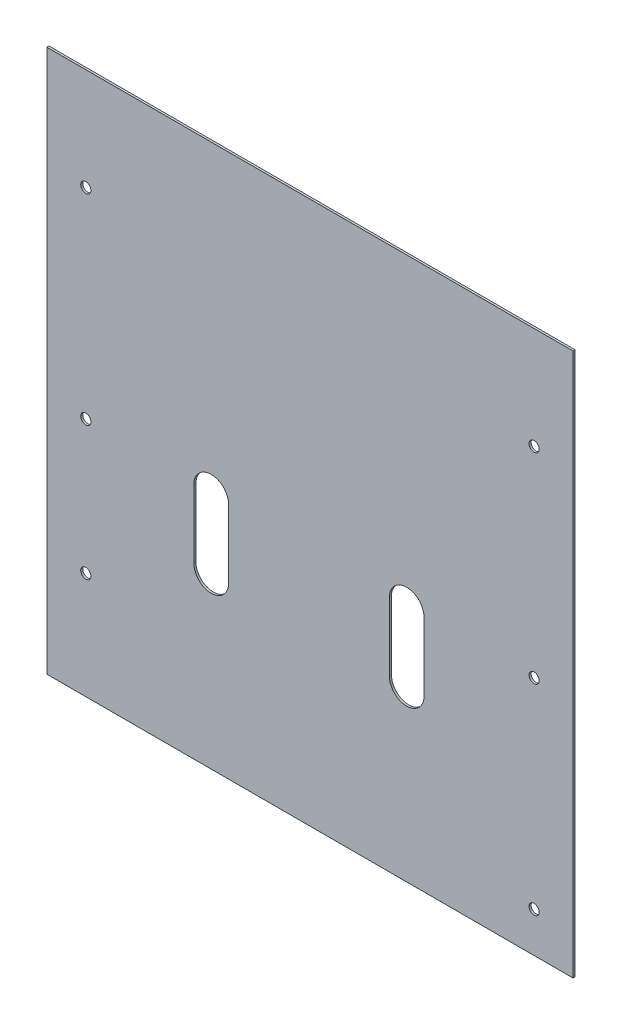
ISO-10303-21;
HEADER;
FILE_DESCRIPTION(('STEP AP214'),'2;1');
FILE_NAME('part.step','',(''),(''),'','','');
FILE_SCHEMA(('AUTOMOTIVE_DESIGN { 1 0 10303 214 1 1 1 1 }'));
ENDSEC;
DATA;
#1=APPLICATION_CONTEXT('core data for automotive mechanical design processes');
#2=APPLICATION_PROTOCOL_DEFINITION('international standard','automotive_design',2000,#1);
#3=PRODUCT_CONTEXT('',#1,'mechanical');
#4=PRODUCT('Part','Part','',(#3));
#5=PRODUCT_RELATED_PRODUCT_CATEGORY('part','',(#4));
#6=PRODUCT_DEFINITION_FORMATION('','',#4);
#7=PRODUCT_DEFINITION_CONTEXT('part definition',#1,'design');
#8=PRODUCT_DEFINITION('design','',#6,#7);
#9=PRODUCT_DEFINITION_SHAPE('','',#8);
#10=(LENGTH_UNIT() NAMED_UNIT(*) SI_UNIT(.MILLI.,.METRE.));
#11=(NAMED_UNIT(*) PLANE_ANGLE_UNIT() SI_UNIT($,.RADIAN.));
#12=(NAMED_UNIT(*) SI_UNIT($,.STERADIAN.) SOLID_ANGLE_UNIT());
#13=UNCERTAINTY_MEASURE_WITH_UNIT(LENGTH_MEASURE(1.E-05),#10,'distance_accuracy_value','');
#14=(GEOMETRIC_REPRESENTATION_CONTEXT(3) GLOBAL_UNCERTAINTY_ASSIGNED_CONTEXT((#13)) GLOBAL_UNIT_ASSIGNED_CONTEXT((#10,
#11,#12)) REPRESENTATION_CONTEXT('',''));
#15=CARTESIAN_POINT('',(0.,0.,0.));
#16=DIRECTION('',(0.,0.,1.));
#17=DIRECTION('',(1.,0.,0.));
#18=AXIS2_PLACEMENT_3D('',#15,#16,#17);
#19=CARTESIAN_POINT('',(0.,0.,0.));
#20=DIRECTION('',(0.,0.,-1.));
#21=DIRECTION('',(-1.,0.,0.));
#22=AXIS2_PLACEMENT_3D('',#19,#20,#21);
#23=PLANE('',#22);
#24=CARTESIAN_POINT('',(-20.9050000000001,-222.,0.));
#25=DIRECTION('',(0.,0.,1.));
#26=DIRECTION('',(1.,0.,0.));
#27=AXIS2_PLACEMENT_3D('',#24,#25,#26);
#28=CIRCLE('',#27,1.905);
#29=CARTESIAN_POINT('',(-19.0000000000001,-222.,0.));
#30=VERTEX_POINT('',#29);
#31=EDGE_CURVE('E268',#30,#30,#28,.T.);
#32=ORIENTED_EDGE('',*,*,#31,.F.);
#33=EDGE_LOOP('',(#32));
#34=FACE_BOUND('',#33,.T.);
#35=CARTESIAN_POINT('',(-20.9050000000003,-147.,0.));
#36=DIRECTION('',(0.,0.,1.));
#37=DIRECTION('',(1.,0.,0.));
#38=AXIS2_PLACEMENT_3D('',#35,#36,#37);
#39=CIRCLE('',#38,1.905);
#40=CARTESIAN_POINT('',(-19.0000000000003,-147.,0.));
#41=VERTEX_POINT('',#40);
#42=EDGE_CURVE('E272',#41,#41,#39,.T.);
#43=ORIENTED_EDGE('',*,*,#42,.F.);
#44=EDGE_LOOP('',(#43));
#45=FACE_BOUND('',#44,.T.);
#46=CARTESIAN_POINT('',(-20.9050000000003,-71.9999999999999,0.));
#47=DIRECTION('',(0.,0.,1.));
#48=DIRECTION('',(1.,0.,0.));
#49=AXIS2_PLACEMENT_3D('',#46,#47,#48);
#50=CIRCLE('',#49,1.905);
#51=CARTESIAN_POINT('',(-19.0000000000003,-71.9999999999999,0.));
#52=VERTEX_POINT('',#51);
#53=EDGE_CURVE('E282',#52,#52,#50,.T.);
#54=ORIENTED_EDGE('',*,*,#53,.F.);
#55=EDGE_LOOP('',(#54));
#56=FACE_BOUND('',#55,.T.);
#57=CARTESIAN_POINT('',(-188.645,-197.,0.));
#58=DIRECTION('',(0.,0.,1.));
#59=DIRECTION('',(1.,0.,0.));
#60=AXIS2_PLACEMENT_3D('',#57,#58,#59);
#61=CIRCLE('',#60,1.90499999999999);
#62=CARTESIAN_POINT('',(-186.74,-197.,0.));
#63=VERTEX_POINT('',#62);
#64=EDGE_CURVE('E290',#63,#63,#61,.T.);
#65=ORIENTED_EDGE('',*,*,#64,.F.);
#66=EDGE_LOOP('',(#65));
#67=FACE_BOUND('',#66,.T.);
#68=CARTESIAN_POINT('',(-188.645,-147.,0.));
#69=DIRECTION('',(0.,0.,1.));
#70=DIRECTION('',(1.,0.,0.));
#71=AXIS2_PLACEMENT_3D('',#68,#69,#70);
#72=CIRCLE('',#71,1.90499999999999);
#73=CARTESIAN_POINT('',(-186.74,-147.,0.));
#74=VERTEX_POINT('',#73);
#75=EDGE_CURVE('E298',#74,#74,#72,.T.);
#76=ORIENTED_EDGE('',*,*,#75,.F.);
#77=EDGE_LOOP('',(#76));
#78=FACE_BOUND('',#77,.T.);
#79=CARTESIAN_POINT('',(-188.645,-72.,0.));
#80=DIRECTION('',(0.,0.,1.));
#81=DIRECTION('',(1.,0.,0.));
#82=AXIS2_PLACEMENT_3D('',#79,#80,#81);
#83=CIRCLE('',#82,1.90499999999999);
#84=CARTESIAN_POINT('',(-186.74,-72.,0.));
#85=VERTEX_POINT('',#84);
#86=EDGE_CURVE('E306',#85,#85,#83,.T.);
#87=ORIENTED_EDGE('',*,*,#86,.F.);
#88=EDGE_LOOP('',(#87));
#89=FACE_BOUND('',#88,.T.);
#90=DIRECTION('',(0.,-1.,0.));
#91=VECTOR('',#90,1.);
#92=CARTESIAN_POINT('',(-62.0692532358968,-173.5,0.));
#93=LINE('',#92,#91);
#94=CARTESIAN_POINT('',(-62.0692532358968,-148.,0.));
#95=VERTEX_POINT('',#94);
#96=CARTESIAN_POINT('',(-62.0692532358968,-173.5,0.));
#97=VERTEX_POINT('',#96);
#98=EDGE_CURVE('E368',#95,#97,#93,.T.);
#99=ORIENTED_EDGE('',*,*,#98,.T.);
#100=CARTESIAN_POINT('',(-68.5692532358968,-173.5,0.));
#101=DIRECTION('',(0.,0.,-1.));
#102=DIRECTION('',(0.,1.,0.));
#103=AXIS2_PLACEMENT_3D('',#100,#101,#102);
#104=CIRCLE('',#103,6.5);
#105=CARTESIAN_POINT('',(-75.0692532358968,-173.5,0.));
#106=VERTEX_POINT('',#105);
#107=EDGE_CURVE('E355',#97,#106,#104,.T.);
#108=ORIENTED_EDGE('',*,*,#107,.T.);
#109=DIRECTION('',(0.,1.,0.));
#110=VECTOR('',#109,1.);
#111=CARTESIAN_POINT('',(-75.0692532358968,-173.5,0.));
#112=LINE('',#111,#110);
#113=CARTESIAN_POINT('',(-75.0692532358968,-148.,0.));
#114=VERTEX_POINT('',#113);
#115=EDGE_CURVE('E359',#106,#114,#112,.T.);
#116=ORIENTED_EDGE('',*,*,#115,.T.);
#117=CARTESIAN_POINT('',(-68.5692532358968,-148.,0.));
#118=DIRECTION('',(0.,0.,-1.));
#119=DIRECTION('',(0.,1.,0.));
#120=AXIS2_PLACEMENT_3D('',#117,#118,#119);
#121=CIRCLE('',#120,6.5);
#122=EDGE_CURVE('E364',#114,#95,#121,.T.);
#123=ORIENTED_EDGE('',*,*,#122,.T.);
#124=EDGE_LOOP('',(#99,#108,#116,#123));
#125=FACE_BOUND('',#124,.T.);
#126=DIRECTION('',(0.,-1.,0.));
#127=VECTOR('',#126,1.);
#128=CARTESIAN_POINT('',(-135.221253235897,-173.5,0.));
#129=LINE('',#128,#127);
#130=CARTESIAN_POINT('',(-135.221253235897,-148.,0.));
#131=VERTEX_POINT('',#130);
#132=CARTESIAN_POINT('',(-135.221253235897,-173.5,0.));
#133=VERTEX_POINT('',#132);
#134=EDGE_CURVE('E326',#131,#133,#129,.T.);
#135=ORIENTED_EDGE('',*,*,#134,.T.);
#136=CARTESIAN_POINT('',(-141.721253235897,-173.5,0.));
#137=DIRECTION('',(0.,0.,-1.));
#138=DIRECTION('',(0.,1.,0.));
#139=AXIS2_PLACEMENT_3D('',#136,#137,#138);
#140=CIRCLE('',#139,6.49999999999995);
#141=CARTESIAN_POINT('',(-148.221253235897,-173.5,0.));
#142=VERTEX_POINT('',#141);
#143=EDGE_CURVE('E313',#133,#142,#140,.T.);
#144=ORIENTED_EDGE('',*,*,#143,.T.);
#145=DIRECTION('',(0.,1.,0.));
#146=VECTOR('',#145,1.);
#147=CARTESIAN_POINT('',(-148.221253235897,-173.5,0.));
#148=LINE('',#147,#146);
#149=CARTESIAN_POINT('',(-148.221253235897,-148.,0.));
#150=VERTEX_POINT('',#149);
#151=EDGE_CURVE('E317',#142,#150,#148,.T.);
#152=ORIENTED_EDGE('',*,*,#151,.T.);
#153=CARTESIAN_POINT('',(-141.721253235897,-148.,0.));
#154=DIRECTION('',(0.,0.,-1.));
#155=DIRECTION('',(0.,1.,0.));
#156=AXIS2_PLACEMENT_3D('',#153,#154,#155);
#157=CIRCLE('',#156,6.49999999999995);
#158=EDGE_CURVE('E322',#150,#131,#157,.T.);
#159=ORIENTED_EDGE('',*,*,#158,.T.);
#160=EDGE_LOOP('',(#135,#144,#152,#159));
#161=FACE_BOUND('',#160,.T.);
#162=DIRECTION('',(-1.,0.,0.));
#163=VECTOR('',#162,1.);
#164=CARTESIAN_POINT('',(-203.2,-237.,0.));
#165=LINE('',#164,#163);
#166=CARTESIAN_POINT('',(-6.35000000000001,-237.,0.));
#167=VERTEX_POINT('',#166);
#168=CARTESIAN_POINT('',(-203.2,-237.,0.));
#169=VERTEX_POINT('',#168);
#170=EDGE_CURVE('E166',#167,#169,#165,.T.);
#171=ORIENTED_EDGE('',*,*,#170,.F.);
#172=DIRECTION('',(0.,-1.,0.));
#173=VECTOR('',#172,1.);
#174=CARTESIAN_POINT('',(-6.35000000000001,-237.,0.));
#175=LINE('',#174,#173);
#176=CARTESIAN_POINT('',(-6.35000000000006,-33.7999999999999,0.));
#177=VERTEX_POINT('',#176);
#178=EDGE_CURVE('E142',#177,#167,#175,.T.);
#179=ORIENTED_EDGE('',*,*,#178,.F.);
#180=DIRECTION('',(-1.,0.,0.));
#181=VECTOR('',#180,1.);
#182=CARTESIAN_POINT('',(-6.35000000000006,-33.7999999999999,0.));
#183=LINE('',#182,#181);
#184=CARTESIAN_POINT('',(-203.2,-33.8,0.));
#185=VERTEX_POINT('',#184);
#186=EDGE_CURVE('E146',#177,#185,#183,.T.);
#187=ORIENTED_EDGE('',*,*,#186,.T.);
#188=DIRECTION('',(0.,1.,0.));
#189=VECTOR('',#188,1.);
#190=CARTESIAN_POINT('',(-203.2,-237.,0.));
#191=LINE('',#190,#189);
#192=EDGE_CURVE('E134',#169,#185,#191,.T.);
#193=ORIENTED_EDGE('',*,*,#192,.F.);
#194=EDGE_LOOP('',(#171,#179,#187,#193));
#195=FACE_BOUND('',#194,.T.);
#196=ADVANCED_FACE('F43',(#34,#45,#56,#67,#78,#89,#125,#161,#195),#23,.F.);
#197=CARTESIAN_POINT('',(-203.2,-237.,-0.7747));
#198=DIRECTION('',(1.,0.,0.));
#199=DIRECTION('',(0.,1.,0.));
#200=AXIS2_PLACEMENT_3D('',#197,#198,#199);
#201=PLANE('',#200);
#202=ORIENTED_EDGE('',*,*,#192,.T.);
#203=DIRECTION('',(0.,0.,1.));
#204=VECTOR('',#203,1.);
#205=CARTESIAN_POINT('',(-203.2,-33.7999999999999,-0.7747));
#206=LINE('',#205,#204);
#207=CARTESIAN_POINT('',(-203.2,-33.7999999999999,-0.7747));
#208=VERTEX_POINT('',#207);
#209=EDGE_CURVE('E11',#208,#185,#206,.T.);
#210=ORIENTED_EDGE('',*,*,#209,.F.);
#211=DIRECTION('',(0.,1.,0.));
#212=VECTOR('',#211,1.);
#213=CARTESIAN_POINT('',(-203.2,-237.,-0.7747));
#214=LINE('',#213,#212);
#215=CARTESIAN_POINT('',(-203.2,-237.,-0.7747));
#216=VERTEX_POINT('',#215);
#217=EDGE_CURVE('E160',#216,#208,#214,.T.);
#218=ORIENTED_EDGE('',*,*,#217,.F.);
#219=DIRECTION('',(0.,0.,1.));
#220=VECTOR('',#219,1.);
#221=CARTESIAN_POINT('',(-203.2,-237.,-0.7747));
#222=LINE('',#221,#220);
#223=EDGE_CURVE('E138',#216,#169,#222,.T.);
#224=ORIENTED_EDGE('',*,*,#223,.T.);
#225=EDGE_LOOP('',(#202,#210,#218,#224));
#226=FACE_BOUND('',#225,.T.);
#227=ADVANCED_FACE('F45',(#226),#201,.F.);
#228=CARTESIAN_POINT('',(-203.2,-33.7999999999999,-0.7747));
#229=DIRECTION('',(0.,-1.,0.));
#230=DIRECTION('',(1.,0.,0.));
#231=AXIS2_PLACEMENT_3D('',#228,#229,#230);
#232=PLANE('',#231);
#233=ORIENTED_EDGE('',*,*,#209,.T.);
#234=ORIENTED_EDGE('',*,*,#186,.F.);
#235=DIRECTION('',(0.,0.,1.));
#236=VECTOR('',#235,1.);
#237=CARTESIAN_POINT('',(-6.35000000000006,-33.8,-0.7747));
#238=LINE('',#237,#236);
#239=CARTESIAN_POINT('',(-6.35000000000006,-33.8,-0.7747));
#240=VERTEX_POINT('',#239);
#241=EDGE_CURVE('E52',#240,#177,#238,.T.);
#242=ORIENTED_EDGE('',*,*,#241,.F.);
#243=DIRECTION('',(1.,0.,0.));
#244=VECTOR('',#243,1.);
#245=CARTESIAN_POINT('',(-203.2,-33.7999999999999,-0.7747));
#246=LINE('',#245,#244);
#247=EDGE_CURVE('E155',#208,#240,#246,.T.);
#248=ORIENTED_EDGE('',*,*,#247,.F.);
#249=EDGE_LOOP('',(#233,#234,#242,#248));
#250=FACE_BOUND('',#249,.T.);
#251=ADVANCED_FACE('F154',(#250),#232,.F.);
#252=CARTESIAN_POINT('',(-6.35000000000001,-237.,-0.7747));
#253=DIRECTION('',(-1.,0.,0.));
#254=DIRECTION('',(0.,-1.,0.));
#255=AXIS2_PLACEMENT_3D('',#252,#253,#254);
#256=PLANE('',#255);
#257=ORIENTED_EDGE('',*,*,#241,.T.);
#258=ORIENTED_EDGE('',*,*,#178,.T.);
#259=DIRECTION('',(0.,0.,1.));
#260=VECTOR('',#259,1.);
#261=CARTESIAN_POINT('',(-6.35000000000001,-237.,-0.7747));
#262=LINE('',#261,#260);
#263=CARTESIAN_POINT('',(-6.35000000000001,-237.,-0.7747));
#264=VERTEX_POINT('',#263);
#265=EDGE_CURVE('E178',#264,#167,#262,.T.);
#266=ORIENTED_EDGE('',*,*,#265,.F.);
#267=DIRECTION('',(0.,-1.,0.));
#268=VECTOR('',#267,1.);
#269=CARTESIAN_POINT('',(-6.35000000000001,-237.,-0.7747));
#270=LINE('',#269,#268);
#271=EDGE_CURVE('E159',#240,#264,#270,.T.);
#272=ORIENTED_EDGE('',*,*,#271,.F.);
#273=EDGE_LOOP('',(#257,#258,#266,#272));
#274=FACE_BOUND('',#273,.T.);
#275=ADVANCED_FACE('F183',(#274),#256,.F.);
#276=CARTESIAN_POINT('',(-203.2,-237.,-0.7747));
#277=DIRECTION('',(0.,1.,0.));
#278=DIRECTION('',(0.,0.,1.));
#279=AXIS2_PLACEMENT_3D('',#276,#277,#278);
#280=PLANE('',#279);
#281=ORIENTED_EDGE('',*,*,#170,.T.);
#282=ORIENTED_EDGE('',*,*,#223,.F.);
#283=DIRECTION('',(-1.,0.,0.));
#284=VECTOR('',#283,1.);
#285=CARTESIAN_POINT('',(-203.2,-237.,-0.7747));
#286=LINE('',#285,#284);
#287=EDGE_CURVE('E164',#264,#216,#286,.T.);
#288=ORIENTED_EDGE('',*,*,#287,.F.);
#289=ORIENTED_EDGE('',*,*,#265,.T.);
#290=EDGE_LOOP('',(#281,#282,#288,#289));
#291=FACE_BOUND('',#290,.T.);
#292=ADVANCED_FACE('F189',(#291),#280,.F.);
#293=CARTESIAN_POINT('',(0.,0.,-0.7747));
#294=DIRECTION('',(0.,0.,-1.));
#295=DIRECTION('',(-1.,0.,0.));
#296=AXIS2_PLACEMENT_3D('',#293,#294,#295);
#297=PLANE('',#296);
#298=CARTESIAN_POINT('',(-20.9050000000001,-222.,-0.7747));
#299=DIRECTION('',(0.,0.,1.));
#300=DIRECTION('',(1.,0.,0.));
#301=AXIS2_PLACEMENT_3D('',#298,#299,#300);
#302=CIRCLE('',#301,1.905);
#303=CARTESIAN_POINT('',(-19.0000000000001,-222.,-0.7747));
#304=VERTEX_POINT('',#303);
#305=EDGE_CURVE('E266',#304,#304,#302,.T.);
#306=ORIENTED_EDGE('',*,*,#305,.T.);
#307=EDGE_LOOP('',(#306));
#308=FACE_BOUND('',#307,.T.);
#309=CARTESIAN_POINT('',(-20.9050000000003,-147.,-0.7747));
#310=DIRECTION('',(0.,0.,1.));
#311=DIRECTION('',(1.,0.,0.));
#312=AXIS2_PLACEMENT_3D('',#309,#310,#311);
#313=CIRCLE('',#312,1.905);
#314=CARTESIAN_POINT('',(-19.0000000000003,-147.,-0.7747));
#315=VERTEX_POINT('',#314);
#316=EDGE_CURVE('E278',#315,#315,#313,.T.);
#317=ORIENTED_EDGE('',*,*,#316,.T.);
#318=EDGE_LOOP('',(#317));
#319=FACE_BOUND('',#318,.T.);
#320=CARTESIAN_POINT('',(-20.9050000000003,-71.9999999999999,-0.7747));
#321=DIRECTION('',(0.,0.,1.));
#322=DIRECTION('',(1.,0.,0.));
#323=AXIS2_PLACEMENT_3D('',#320,#321,#322);
#324=CIRCLE('',#323,1.905);
#325=CARTESIAN_POINT('',(-19.0000000000003,-71.9999999999999,-0.7747));
#326=VERTEX_POINT('',#325);
#327=EDGE_CURVE('E286',#326,#326,#324,.T.);
#328=ORIENTED_EDGE('',*,*,#327,.T.);
#329=EDGE_LOOP('',(#328));
#330=FACE_BOUND('',#329,.T.);
#331=CARTESIAN_POINT('',(-188.645,-197.,-0.7747));
#332=DIRECTION('',(0.,0.,1.));
#333=DIRECTION('',(1.,0.,0.));
#334=AXIS2_PLACEMENT_3D('',#331,#332,#333);
#335=CIRCLE('',#334,1.90499999999999);
#336=CARTESIAN_POINT('',(-186.74,-197.,-0.7747));
#337=VERTEX_POINT('',#336);
#338=EDGE_CURVE('E294',#337,#337,#335,.T.);
#339=ORIENTED_EDGE('',*,*,#338,.T.);
#340=EDGE_LOOP('',(#339));
#341=FACE_BOUND('',#340,.T.);
#342=CARTESIAN_POINT('',(-188.645,-147.,-0.7747));
#343=DIRECTION('',(0.,0.,1.));
#344=DIRECTION('',(1.,0.,0.));
#345=AXIS2_PLACEMENT_3D('',#342,#343,#344);
#346=CIRCLE('',#345,1.90499999999999);
#347=CARTESIAN_POINT('',(-186.74,-147.,-0.7747));
#348=VERTEX_POINT('',#347);
#349=EDGE_CURVE('E302',#348,#348,#346,.T.);
#350=ORIENTED_EDGE('',*,*,#349,.T.);
#351=EDGE_LOOP('',(#350));
#352=FACE_BOUND('',#351,.T.);
#353=CARTESIAN_POINT('',(-188.645,-72.,-0.7747));
#354=DIRECTION('',(0.,0.,1.));
#355=DIRECTION('',(1.,0.,0.));
#356=AXIS2_PLACEMENT_3D('',#353,#354,#355);
#357=CIRCLE('',#356,1.90499999999999);
#358=CARTESIAN_POINT('',(-186.74,-72.,-0.7747));
#359=VERTEX_POINT('',#358);
#360=EDGE_CURVE('E151',#359,#359,#357,.T.);
#361=ORIENTED_EDGE('',*,*,#360,.T.);
#362=EDGE_LOOP('',(#361));
#363=FACE_BOUND('',#362,.T.);
#364=ORIENTED_EDGE('',*,*,#217,.T.);
#365=ORIENTED_EDGE('',*,*,#247,.T.);
#366=ORIENTED_EDGE('',*,*,#271,.T.);
#367=ORIENTED_EDGE('',*,*,#287,.T.);
#368=EDGE_LOOP('',(#364,#365,#366,#367));
#369=FACE_BOUND('',#368,.T.);
#370=CARTESIAN_POINT('',(-141.721253235897,-173.5,-0.774699999999979));
#371=DIRECTION('',(0.,0.,-1.));
#372=DIRECTION('',(0.,1.,0.));
#373=AXIS2_PLACEMENT_3D('',#370,#371,#372);
#374=CIRCLE('',#373,6.49999999999995);
#375=CARTESIAN_POINT('',(-135.221253235897,-173.5,-0.774699999999979));
#376=VERTEX_POINT('',#375);
#377=CARTESIAN_POINT('',(-148.221253235897,-173.5,-0.7747));
#378=VERTEX_POINT('',#377);
#379=EDGE_CURVE('E59',#376,#378,#374,.T.);
#380=ORIENTED_EDGE('',*,*,#379,.F.);
#381=DIRECTION('',(0.,-1.,0.));
#382=VECTOR('',#381,1.);
#383=CARTESIAN_POINT('',(-135.221253235897,-173.5,-0.774699999999979));
#384=LINE('',#383,#382);
#385=CARTESIAN_POINT('',(-135.221253235897,-148.,-0.774699999999982));
#386=VERTEX_POINT('',#385);
#387=EDGE_CURVE('E318',#386,#376,#384,.T.);
#388=ORIENTED_EDGE('',*,*,#387,.F.);
#389=CARTESIAN_POINT('',(-141.721253235897,-148.,-0.774699999999982));
#390=DIRECTION('',(0.,0.,-1.));
#391=DIRECTION('',(0.,1.,0.));
#392=AXIS2_PLACEMENT_3D('',#389,#390,#391);
#393=CIRCLE('',#392,6.49999999999995);
#394=CARTESIAN_POINT('',(-148.221253235897,-148.,-0.774699999999982));
#395=VERTEX_POINT('',#394);
#396=EDGE_CURVE('E338',#395,#386,#393,.T.);
#397=ORIENTED_EDGE('',*,*,#396,.F.);
#398=DIRECTION('',(0.,1.,0.));
#399=VECTOR('',#398,1.);
#400=CARTESIAN_POINT('',(-148.221253235897,-173.5,-0.774699999999979));
#401=LINE('',#400,#399);
#402=EDGE_CURVE('E333',#378,#395,#401,.T.);
#403=ORIENTED_EDGE('',*,*,#402,.F.);
#404=EDGE_LOOP('',(#380,#388,#397,#403));
#405=FACE_BOUND('',#404,.T.);
#406=CARTESIAN_POINT('',(-68.5692532358968,-173.5,-0.774699999999979));
#407=DIRECTION('',(0.,0.,-1.));
#408=DIRECTION('',(0.,1.,0.));
#409=AXIS2_PLACEMENT_3D('',#406,#407,#408);
#410=CIRCLE('',#409,6.5);
#411=CARTESIAN_POINT('',(-62.0692532358968,-173.5,-0.774699999999979));
#412=VERTEX_POINT('',#411);
#413=CARTESIAN_POINT('',(-75.0692532358968,-173.5,-0.7747));
#414=VERTEX_POINT('',#413);
#415=EDGE_CURVE('E67',#412,#414,#410,.T.);
#416=ORIENTED_EDGE('',*,*,#415,.F.);
#417=DIRECTION('',(0.,-1.,0.));
#418=VECTOR('',#417,1.);
#419=CARTESIAN_POINT('',(-62.0692532358968,-173.5,-0.774699999999979));
#420=LINE('',#419,#418);
#421=CARTESIAN_POINT('',(-62.0692532358968,-148.,-0.774699999999982));
#422=VERTEX_POINT('',#421);
#423=EDGE_CURVE('E360',#422,#412,#420,.T.);
#424=ORIENTED_EDGE('',*,*,#423,.F.);
#425=CARTESIAN_POINT('',(-68.5692532358968,-148.,-0.774699999999982));
#426=DIRECTION('',(0.,0.,-1.));
#427=DIRECTION('',(0.,1.,0.));
#428=AXIS2_PLACEMENT_3D('',#425,#426,#427);
#429=CIRCLE('',#428,6.5);
#430=CARTESIAN_POINT('',(-75.0692532358968,-148.,-0.774699999999982));
#431=VERTEX_POINT('',#430);
#432=EDGE_CURVE('E379',#431,#422,#429,.T.);
#433=ORIENTED_EDGE('',*,*,#432,.F.);
#434=DIRECTION('',(0.,1.,0.));
#435=VECTOR('',#434,1.);
#436=CARTESIAN_POINT('',(-75.0692532358968,-173.5,-0.774699999999979));
#437=LINE('',#436,#435);
#438=EDGE_CURVE('E375',#414,#431,#437,.T.);
#439=ORIENTED_EDGE('',*,*,#438,.F.);
#440=EDGE_LOOP('',(#416,#424,#433,#439));
#441=FACE_BOUND('',#440,.T.);
#442=ADVANCED_FACE('F186',(#308,#319,#330,#341,#352,#363,#369,#405,#441),#297,.T.);
#443=CARTESIAN_POINT('',(-68.5692532358968,-173.5,0.));
#444=DIRECTION('',(0.,0.,-1.));
#445=DIRECTION('',(0.,1.,0.));
#446=AXIS2_PLACEMENT_3D('',#443,#444,#445);
#447=CYLINDRICAL_SURFACE('',#446,6.5);
#448=ORIENTED_EDGE('',*,*,#415,.T.);
#449=DIRECTION('',(0.,0.,-1.));
#450=VECTOR('',#449,1.);
#451=CARTESIAN_POINT('',(-75.0692532358968,-173.5,0.));
#452=LINE('',#451,#450);
#453=EDGE_CURVE('E372',#106,#414,#452,.T.);
#454=ORIENTED_EDGE('',*,*,#453,.F.);
#455=ORIENTED_EDGE('',*,*,#107,.F.);
#456=DIRECTION('',(0.,0.,-1.));
#457=VECTOR('',#456,1.);
#458=CARTESIAN_POINT('',(-62.0692532358968,-173.5,0.));
#459=LINE('',#458,#457);
#460=EDGE_CURVE('E334',#97,#412,#459,.T.);
#461=ORIENTED_EDGE('',*,*,#460,.T.);
#462=EDGE_LOOP('',(#448,#454,#455,#461));
#463=FACE_BOUND('',#462,.T.);
#464=ADVANCED_FACE('F196',(#463),#447,.F.);
#465=CARTESIAN_POINT('',(-62.0692532358968,-173.5,0.));
#466=DIRECTION('',(1.,0.,0.));
#467=DIRECTION('',(0.,1.,0.));
#468=AXIS2_PLACEMENT_3D('',#465,#466,#467);
#469=PLANE('',#468);
#470=ORIENTED_EDGE('',*,*,#423,.T.);
#471=ORIENTED_EDGE('',*,*,#460,.F.);
#472=ORIENTED_EDGE('',*,*,#98,.F.);
#473=DIRECTION('',(0.,0.,-1.));
#474=VECTOR('',#473,1.);
#475=CARTESIAN_POINT('',(-62.0692532358968,-148.,0.));
#476=LINE('',#475,#474);
#477=EDGE_CURVE('E388',#95,#422,#476,.T.);
#478=ORIENTED_EDGE('',*,*,#477,.T.);
#479=EDGE_LOOP('',(#470,#471,#472,#478));
#480=FACE_BOUND('',#479,.T.);
#481=ADVANCED_FACE('F211',(#480),#469,.F.);
#482=CARTESIAN_POINT('',(-68.5692532358968,-148.,0.));
#483=DIRECTION('',(0.,0.,-1.));
#484=DIRECTION('',(0.,1.,0.));
#485=AXIS2_PLACEMENT_3D('',#482,#483,#484);
#486=CYLINDRICAL_SURFACE('',#485,6.5);
#487=ORIENTED_EDGE('',*,*,#432,.T.);
#488=ORIENTED_EDGE('',*,*,#477,.F.);
#489=ORIENTED_EDGE('',*,*,#122,.F.);
#490=DIRECTION('',(0.,0.,-1.));
#491=VECTOR('',#490,1.);
#492=CARTESIAN_POINT('',(-75.0692532358968,-148.,0.));
#493=LINE('',#492,#491);
#494=EDGE_CURVE('E391',#114,#431,#493,.T.);
#495=ORIENTED_EDGE('',*,*,#494,.T.);
#496=EDGE_LOOP('',(#487,#488,#489,#495));
#497=FACE_BOUND('',#496,.T.);
#498=ADVANCED_FACE('F216',(#497),#486,.F.);
#499=CARTESIAN_POINT('',(-75.0692532358968,-173.5,0.));
#500=DIRECTION('',(-1.,0.,0.));
#501=DIRECTION('',(0.,-1.,0.));
#502=AXIS2_PLACEMENT_3D('',#499,#500,#501);
#503=PLANE('',#502);
#504=ORIENTED_EDGE('',*,*,#438,.T.);
#505=ORIENTED_EDGE('',*,*,#494,.F.);
#506=ORIENTED_EDGE('',*,*,#115,.F.);
#507=ORIENTED_EDGE('',*,*,#453,.T.);
#508=EDGE_LOOP('',(#504,#505,#506,#507));
#509=FACE_BOUND('',#508,.T.);
#510=ADVANCED_FACE('F212',(#509),#503,.F.);
#511=CARTESIAN_POINT('',(-141.721253235897,-173.5,0.));
#512=DIRECTION('',(0.,0.,-1.));
#513=DIRECTION('',(0.,1.,0.));
#514=AXIS2_PLACEMENT_3D('',#511,#512,#513);
#515=CYLINDRICAL_SURFACE('',#514,6.49999999999995);
#516=ORIENTED_EDGE('',*,*,#379,.T.);
#517=DIRECTION('',(0.,0.,-1.));
#518=VECTOR('',#517,1.);
#519=CARTESIAN_POINT('',(-148.221253235897,-173.5,0.));
#520=LINE('',#519,#518);
#521=EDGE_CURVE('E330',#142,#378,#520,.T.);
#522=ORIENTED_EDGE('',*,*,#521,.F.);
#523=ORIENTED_EDGE('',*,*,#143,.F.);
#524=DIRECTION('',(0.,0.,-1.));
#525=VECTOR('',#524,1.);
#526=CARTESIAN_POINT('',(-135.221253235897,-173.5,0.));
#527=LINE('',#526,#525);
#528=EDGE_CURVE('E143',#133,#376,#527,.T.);
#529=ORIENTED_EDGE('',*,*,#528,.T.);
#530=EDGE_LOOP('',(#516,#522,#523,#529));
#531=FACE_BOUND('',#530,.T.);
#532=ADVANCED_FACE('F215',(#531),#515,.F.);
#533=CARTESIAN_POINT('',(-135.221253235897,-173.5,0.));
#534=DIRECTION('',(1.,0.,0.));
#535=DIRECTION('',(0.,0.,-1.));
#536=AXIS2_PLACEMENT_3D('',#533,#534,#535);
#537=PLANE('',#536);
#538=ORIENTED_EDGE('',*,*,#387,.T.);
#539=ORIENTED_EDGE('',*,*,#528,.F.);
#540=ORIENTED_EDGE('',*,*,#134,.F.);
#541=DIRECTION('',(0.,0.,-1.));
#542=VECTOR('',#541,1.);
#543=CARTESIAN_POINT('',(-135.221253235897,-148.,0.));
#544=LINE('',#543,#542);
#545=EDGE_CURVE('E347',#131,#386,#544,.T.);
#546=ORIENTED_EDGE('',*,*,#545,.T.);
#547=EDGE_LOOP('',(#538,#539,#540,#546));
#548=FACE_BOUND('',#547,.T.);
#549=ADVANCED_FACE('F226',(#548),#537,.F.);
#550=CARTESIAN_POINT('',(-141.721253235897,-148.,0.));
#551=DIRECTION('',(0.,0.,-1.));
#552=DIRECTION('',(0.,1.,0.));
#553=AXIS2_PLACEMENT_3D('',#550,#551,#552);
#554=CYLINDRICAL_SURFACE('',#553,6.49999999999995);
#555=ORIENTED_EDGE('',*,*,#396,.T.);
#556=ORIENTED_EDGE('',*,*,#545,.F.);
#557=ORIENTED_EDGE('',*,*,#158,.F.);
#558=DIRECTION('',(0.,0.,-1.));
#559=VECTOR('',#558,1.);
#560=CARTESIAN_POINT('',(-148.221253235897,-148.,0.));
#561=LINE('',#560,#559);
#562=EDGE_CURVE('E350',#150,#395,#561,.T.);
#563=ORIENTED_EDGE('',*,*,#562,.T.);
#564=EDGE_LOOP('',(#555,#556,#557,#563));
#565=FACE_BOUND('',#564,.T.);
#566=ADVANCED_FACE('F231',(#565),#554,.F.);
#567=CARTESIAN_POINT('',(-148.221253235897,-173.5,0.));
#568=DIRECTION('',(-1.,0.,0.));
#569=DIRECTION('',(0.,0.,1.));
#570=AXIS2_PLACEMENT_3D('',#567,#568,#569);
#571=PLANE('',#570);
#572=ORIENTED_EDGE('',*,*,#402,.T.);
#573=ORIENTED_EDGE('',*,*,#562,.F.);
#574=ORIENTED_EDGE('',*,*,#151,.F.);
#575=ORIENTED_EDGE('',*,*,#521,.T.);
#576=EDGE_LOOP('',(#572,#573,#574,#575));
#577=FACE_BOUND('',#576,.T.);
#578=ADVANCED_FACE('F227',(#577),#571,.F.);
#579=CARTESIAN_POINT('',(-188.645,-72.,0.));
#580=DIRECTION('',(0.,0.,1.));
#581=DIRECTION('',(1.,0.,0.));
#582=AXIS2_PLACEMENT_3D('',#579,#580,#581);
#583=CYLINDRICAL_SURFACE('',#582,1.90499999999999);
#584=ORIENTED_EDGE('',*,*,#360,.F.);
#585=EDGE_LOOP('',(#584));
#586=FACE_BOUND('',#585,.T.);
#587=ORIENTED_EDGE('',*,*,#86,.T.);
#588=EDGE_LOOP('',(#587));
#589=FACE_BOUND('',#588,.T.);
#590=ADVANCED_FACE('F230',(#586,#589),#583,.F.);
#591=CARTESIAN_POINT('',(-188.645,-147.,0.));
#592=DIRECTION('',(0.,0.,1.));
#593=DIRECTION('',(1.,0.,0.));
#594=AXIS2_PLACEMENT_3D('',#591,#592,#593);
#595=CYLINDRICAL_SURFACE('',#594,1.90499999999999);
#596=ORIENTED_EDGE('',*,*,#349,.F.);
#597=EDGE_LOOP('',(#596));
#598=FACE_BOUND('',#597,.T.);
#599=ORIENTED_EDGE('',*,*,#75,.T.);
#600=EDGE_LOOP('',(#599));
#601=FACE_BOUND('',#600,.T.);
#602=ADVANCED_FACE('F241',(#598,#601),#595,.F.);
#603=CARTESIAN_POINT('',(-188.645,-197.,0.));
#604=DIRECTION('',(0.,0.,1.));
#605=DIRECTION('',(1.,0.,0.));
#606=AXIS2_PLACEMENT_3D('',#603,#604,#605);
#607=CYLINDRICAL_SURFACE('',#606,1.90499999999999);
#608=ORIENTED_EDGE('',*,*,#338,.F.);
#609=EDGE_LOOP('',(#608));
#610=FACE_BOUND('',#609,.T.);
#611=ORIENTED_EDGE('',*,*,#64,.T.);
#612=EDGE_LOOP('',(#611));
#613=FACE_BOUND('',#612,.T.);
#614=ADVANCED_FACE('F245',(#610,#613),#607,.F.);
#615=CARTESIAN_POINT('',(-20.9050000000003,-71.9999999999999,0.));
#616=DIRECTION('',(0.,0.,1.));
#617=DIRECTION('',(1.,0.,0.));
#618=AXIS2_PLACEMENT_3D('',#615,#616,#617);
#619=CYLINDRICAL_SURFACE('',#618,1.905);
#620=ORIENTED_EDGE('',*,*,#327,.F.);
#621=EDGE_LOOP('',(#620));
#622=FACE_BOUND('',#621,.T.);
#623=ORIENTED_EDGE('',*,*,#53,.T.);
#624=EDGE_LOOP('',(#623));
#625=FACE_BOUND('',#624,.T.);
#626=ADVANCED_FACE('F249',(#622,#625),#619,.F.);
#627=CARTESIAN_POINT('',(-20.9050000000003,-147.,0.));
#628=DIRECTION('',(0.,0.,1.));
#629=DIRECTION('',(1.,0.,0.));
#630=AXIS2_PLACEMENT_3D('',#627,#628,#629);
#631=CYLINDRICAL_SURFACE('',#630,1.905);
#632=ORIENTED_EDGE('',*,*,#316,.F.);
#633=EDGE_LOOP('',(#632));
#634=FACE_BOUND('',#633,.T.);
#635=ORIENTED_EDGE('',*,*,#42,.T.);
#636=EDGE_LOOP('',(#635));
#637=FACE_BOUND('',#636,.T.);
#638=ADVANCED_FACE('F253',(#634,#637),#631,.F.);
#639=CARTESIAN_POINT('',(-20.9050000000001,-222.,0.));
#640=DIRECTION('',(0.,0.,1.));
#641=DIRECTION('',(1.,0.,0.));
#642=AXIS2_PLACEMENT_3D('',#639,#640,#641);
#643=CYLINDRICAL_SURFACE('',#642,1.905);
#644=ORIENTED_EDGE('',*,*,#305,.F.);
#645=EDGE_LOOP('',(#644));
#646=FACE_BOUND('',#645,.T.);
#647=ORIENTED_EDGE('',*,*,#31,.T.);
#648=EDGE_LOOP('',(#647));
#649=FACE_BOUND('',#648,.T.);
#650=ADVANCED_FACE('F257',(#646,#649),#643,.F.);
#651=CLOSED_SHELL('',(#196,#227,#251,#275,#292,#442,#464,#481,#498,#510,#532,#549,#566,#578,
#590,#602,#614,#626,#638,#650));
#652=MANIFOLD_SOLID_BREP('B2',#651);
#653=ADVANCED_BREP_SHAPE_REPRESENTATION('',(#18,#652),#14);
#654=SHAPE_DEFINITION_REPRESENTATION(#9,#653);
ENDSEC;
END-ISO-10303-21;
